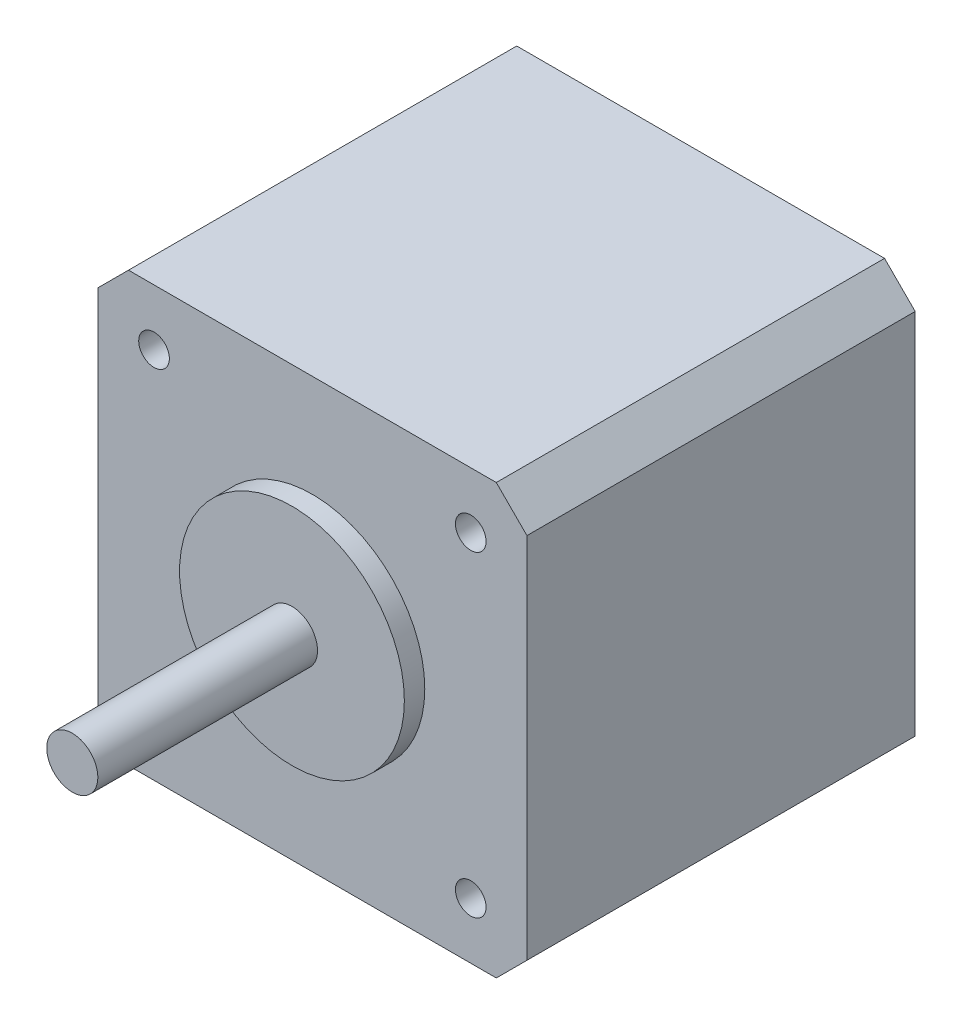
ISO-10303-21;
HEADER;
FILE_DESCRIPTION(('STEP AP214'),'2;1');
FILE_NAME('part.step','',(''),(''),'','','');
FILE_SCHEMA(('AUTOMOTIVE_DESIGN { 1 0 10303 214 1 1 1 1 }'));
ENDSEC;
DATA;
#1=APPLICATION_CONTEXT('core data for automotive mechanical design processes');
#2=APPLICATION_PROTOCOL_DEFINITION('international standard','automotive_design',2000,#1);
#3=PRODUCT_CONTEXT('',#1,'mechanical');
#4=PRODUCT('Part','Part','',(#3));
#5=PRODUCT_RELATED_PRODUCT_CATEGORY('part','',(#4));
#6=PRODUCT_DEFINITION_FORMATION('','',#4);
#7=PRODUCT_DEFINITION_CONTEXT('part definition',#1,'design');
#8=PRODUCT_DEFINITION('design','',#6,#7);
#9=PRODUCT_DEFINITION_SHAPE('','',#8);
#10=(LENGTH_UNIT() NAMED_UNIT(*) SI_UNIT(.MILLI.,.METRE.));
#11=(NAMED_UNIT(*) PLANE_ANGLE_UNIT() SI_UNIT($,.RADIAN.));
#12=(NAMED_UNIT(*) SI_UNIT($,.STERADIAN.) SOLID_ANGLE_UNIT());
#13=UNCERTAINTY_MEASURE_WITH_UNIT(LENGTH_MEASURE(1.E-05),#10,'distance_accuracy_value','');
#14=(GEOMETRIC_REPRESENTATION_CONTEXT(3) GLOBAL_UNCERTAINTY_ASSIGNED_CONTEXT((#13)) GLOBAL_UNIT_ASSIGNED_CONTEXT((#10,
#11,#12)) REPRESENTATION_CONTEXT('',''));
#15=CARTESIAN_POINT('',(0.,0.,0.));
#16=DIRECTION('',(0.,0.,1.));
#17=DIRECTION('',(1.,0.,0.));
#18=AXIS2_PLACEMENT_3D('',#15,#16,#17);
#19=CARTESIAN_POINT('',(21.,21.,38.));
#20=DIRECTION('',(-1.,0.,0.));
#21=DIRECTION('',(0.,0.,1.));
#22=AXIS2_PLACEMENT_3D('',#19,#20,#21);
#23=PLANE('',#22);
#24=DIRECTION('',(0.,1.,0.));
#25=VECTOR('',#24,1.);
#26=CARTESIAN_POINT('',(21.,21.,38.));
#27=LINE('',#26,#25);
#28=CARTESIAN_POINT('',(21.,-18.,38.));
#29=VERTEX_POINT('',#28);
#30=CARTESIAN_POINT('',(21.,18.,38.));
#31=VERTEX_POINT('',#30);
#32=EDGE_CURVE('E132',#29,#31,#27,.T.);
#33=ORIENTED_EDGE('',*,*,#32,.F.);
#34=DIRECTION('',(0.,0.,-1.));
#35=VECTOR('',#34,1.);
#36=CARTESIAN_POINT('',(21.,-18.,38.));
#37=LINE('',#36,#35);
#38=CARTESIAN_POINT('',(21.,-18.,0.));
#39=VERTEX_POINT('',#38);
#40=EDGE_CURVE('E11',#29,#39,#37,.T.);
#41=ORIENTED_EDGE('',*,*,#40,.T.);
#42=DIRECTION('',(0.,1.,0.));
#43=VECTOR('',#42,1.);
#44=CARTESIAN_POINT('',(21.,21.,0.));
#45=LINE('',#44,#43);
#46=CARTESIAN_POINT('',(21.,18.,0.));
#47=VERTEX_POINT('',#46);
#48=EDGE_CURVE('E164',#39,#47,#45,.T.);
#49=ORIENTED_EDGE('',*,*,#48,.T.);
#50=DIRECTION('',(0.,0.,1.));
#51=VECTOR('',#50,1.);
#52=CARTESIAN_POINT('',(21.,18.,38.));
#53=LINE('',#52,#51);
#54=EDGE_CURVE('E46',#47,#31,#53,.T.);
#55=ORIENTED_EDGE('',*,*,#54,.T.);
#56=EDGE_LOOP('',(#33,#41,#49,#55));
#57=FACE_BOUND('',#56,.T.);
#58=ADVANCED_FACE('F38',(#57),#23,.F.);
#59=CARTESIAN_POINT('',(-21.,21.,38.));
#60=DIRECTION('',(0.,-1.,0.));
#61=DIRECTION('',(0.,0.,-1.));
#62=AXIS2_PLACEMENT_3D('',#59,#60,#61);
#63=PLANE('',#62);
#64=DIRECTION('',(-1.,0.,0.));
#65=VECTOR('',#64,1.);
#66=CARTESIAN_POINT('',(-21.,21.,0.));
#67=LINE('',#66,#65);
#68=CARTESIAN_POINT('',(18.,21.,0.));
#69=VERTEX_POINT('',#68);
#70=CARTESIAN_POINT('',(-18.,21.,0.));
#71=VERTEX_POINT('',#70);
#72=EDGE_CURVE('E137',#69,#71,#67,.T.);
#73=ORIENTED_EDGE('',*,*,#72,.T.);
#74=DIRECTION('',(0.,0.,1.));
#75=VECTOR('',#74,1.);
#76=CARTESIAN_POINT('',(-18.,21.,38.));
#77=LINE('',#76,#75);
#78=CARTESIAN_POINT('',(-18.,21.,38.));
#79=VERTEX_POINT('',#78);
#80=EDGE_CURVE('E53',#71,#79,#77,.T.);
#81=ORIENTED_EDGE('',*,*,#80,.T.);
#82=DIRECTION('',(-1.,0.,0.));
#83=VECTOR('',#82,1.);
#84=CARTESIAN_POINT('',(-21.,21.,38.));
#85=LINE('',#84,#83);
#86=CARTESIAN_POINT('',(18.,21.,38.));
#87=VERTEX_POINT('',#86);
#88=EDGE_CURVE('E135',#87,#79,#85,.T.);
#89=ORIENTED_EDGE('',*,*,#88,.F.);
#90=DIRECTION('',(0.,0.,-1.));
#91=VECTOR('',#90,1.);
#92=CARTESIAN_POINT('',(18.,21.,38.));
#93=LINE('',#92,#91);
#94=EDGE_CURVE('E156',#87,#69,#93,.T.);
#95=ORIENTED_EDGE('',*,*,#94,.T.);
#96=EDGE_LOOP('',(#73,#81,#89,#95));
#97=FACE_BOUND('',#96,.T.);
#98=ADVANCED_FACE('F171',(#97),#63,.F.);
#99=CARTESIAN_POINT('',(-21.,21.,38.));
#100=DIRECTION('',(1.,0.,0.));
#101=DIRECTION('',(0.,1.,0.));
#102=AXIS2_PLACEMENT_3D('',#99,#100,#101);
#103=PLANE('',#102);
#104=DIRECTION('',(0.,-1.,0.));
#105=VECTOR('',#104,1.);
#106=CARTESIAN_POINT('',(-21.,21.,0.));
#107=LINE('',#106,#105);
#108=CARTESIAN_POINT('',(-21.,18.,0.));
#109=VERTEX_POINT('',#108);
#110=CARTESIAN_POINT('',(-21.,-18.,0.));
#111=VERTEX_POINT('',#110);
#112=EDGE_CURVE('E133',#109,#111,#107,.T.);
#113=ORIENTED_EDGE('',*,*,#112,.T.);
#114=DIRECTION('',(0.,0.,1.));
#115=VECTOR('',#114,1.);
#116=CARTESIAN_POINT('',(-21.,-18.,38.));
#117=LINE('',#116,#115);
#118=CARTESIAN_POINT('',(-21.,-18.,38.));
#119=VERTEX_POINT('',#118);
#120=EDGE_CURVE('E110',#111,#119,#117,.T.);
#121=ORIENTED_EDGE('',*,*,#120,.T.);
#122=DIRECTION('',(0.,-1.,0.));
#123=VECTOR('',#122,1.);
#124=CARTESIAN_POINT('',(-21.,21.,38.));
#125=LINE('',#124,#123);
#126=CARTESIAN_POINT('',(-21.,18.,38.));
#127=VERTEX_POINT('',#126);
#128=EDGE_CURVE('E177',#127,#119,#125,.T.);
#129=ORIENTED_EDGE('',*,*,#128,.F.);
#130=DIRECTION('',(0.,0.,-1.));
#131=VECTOR('',#130,1.);
#132=CARTESIAN_POINT('',(-21.,18.,38.));
#133=LINE('',#132,#131);
#134=EDGE_CURVE('E115',#127,#109,#133,.T.);
#135=ORIENTED_EDGE('',*,*,#134,.T.);
#136=EDGE_LOOP('',(#113,#121,#129,#135));
#137=FACE_BOUND('',#136,.T.);
#138=ADVANCED_FACE('F250',(#137),#103,.F.);
#139=CARTESIAN_POINT('',(-21.,-21.,38.));
#140=DIRECTION('',(0.,1.,0.));
#141=DIRECTION('',(0.,0.,1.));
#142=AXIS2_PLACEMENT_3D('',#139,#140,#141);
#143=PLANE('',#142);
#144=DIRECTION('',(1.,0.,0.));
#145=VECTOR('',#144,1.);
#146=CARTESIAN_POINT('',(-21.,-21.,38.));
#147=LINE('',#146,#145);
#148=CARTESIAN_POINT('',(-18.,-21.,38.));
#149=VERTEX_POINT('',#148);
#150=CARTESIAN_POINT('',(18.,-21.,38.));
#151=VERTEX_POINT('',#150);
#152=EDGE_CURVE('E125',#149,#151,#147,.T.);
#153=ORIENTED_EDGE('',*,*,#152,.F.);
#154=DIRECTION('',(0.,0.,-1.));
#155=VECTOR('',#154,1.);
#156=CARTESIAN_POINT('',(-18.,-21.,38.));
#157=LINE('',#156,#155);
#158=CARTESIAN_POINT('',(-18.,-21.,0.));
#159=VERTEX_POINT('',#158);
#160=EDGE_CURVE('E109',#149,#159,#157,.T.);
#161=ORIENTED_EDGE('',*,*,#160,.T.);
#162=DIRECTION('',(1.,0.,0.));
#163=VECTOR('',#162,1.);
#164=CARTESIAN_POINT('',(-21.,-21.,0.));
#165=LINE('',#164,#163);
#166=CARTESIAN_POINT('',(18.,-21.,0.));
#167=VERTEX_POINT('',#166);
#168=EDGE_CURVE('E122',#159,#167,#165,.T.);
#169=ORIENTED_EDGE('',*,*,#168,.T.);
#170=DIRECTION('',(0.,0.,1.));
#171=VECTOR('',#170,1.);
#172=CARTESIAN_POINT('',(18.,-21.,38.));
#173=LINE('',#172,#171);
#174=EDGE_CURVE('E127',#167,#151,#173,.T.);
#175=ORIENTED_EDGE('',*,*,#174,.T.);
#176=EDGE_LOOP('',(#153,#161,#169,#175));
#177=FACE_BOUND('',#176,.T.);
#178=ADVANCED_FACE('F121',(#177),#143,.F.);
#179=CARTESIAN_POINT('',(0.,0.,38.));
#180=DIRECTION('',(0.,0.,1.));
#181=DIRECTION('',(1.,0.,0.));
#182=AXIS2_PLACEMENT_3D('',#179,#180,#181);
#183=PLANE('',#182);
#184=CARTESIAN_POINT('',(-15.5,15.5,38.));
#185=DIRECTION('',(0.,0.,1.));
#186=DIRECTION('',(1.,0.,0.));
#187=AXIS2_PLACEMENT_3D('',#184,#185,#186);
#188=CIRCLE('',#187,1.5);
#189=CARTESIAN_POINT('',(-14.,15.5,38.));
#190=VERTEX_POINT('',#189);
#191=EDGE_CURVE('E196',#190,#190,#188,.T.);
#192=ORIENTED_EDGE('',*,*,#191,.F.);
#193=EDGE_LOOP('',(#192));
#194=FACE_BOUND('',#193,.T.);
#195=CARTESIAN_POINT('',(-15.5,-15.5,38.));
#196=DIRECTION('',(0.,0.,1.));
#197=DIRECTION('',(1.,0.,0.));
#198=AXIS2_PLACEMENT_3D('',#195,#196,#197);
#199=CIRCLE('',#198,1.5);
#200=CARTESIAN_POINT('',(-14.,-15.5,38.));
#201=VERTEX_POINT('',#200);
#202=EDGE_CURVE('E202',#201,#201,#199,.T.);
#203=ORIENTED_EDGE('',*,*,#202,.F.);
#204=EDGE_LOOP('',(#203));
#205=FACE_BOUND('',#204,.T.);
#206=CARTESIAN_POINT('',(15.5,-15.5,38.));
#207=DIRECTION('',(0.,0.,1.));
#208=DIRECTION('',(1.,0.,0.));
#209=AXIS2_PLACEMENT_3D('',#206,#207,#208);
#210=CIRCLE('',#209,1.5);
#211=CARTESIAN_POINT('',(17.,-15.5,38.));
#212=VERTEX_POINT('',#211);
#213=EDGE_CURVE('E208',#212,#212,#210,.T.);
#214=ORIENTED_EDGE('',*,*,#213,.F.);
#215=EDGE_LOOP('',(#214));
#216=FACE_BOUND('',#215,.T.);
#217=CARTESIAN_POINT('',(15.5,15.5,38.));
#218=DIRECTION('',(0.,0.,1.));
#219=DIRECTION('',(1.,0.,0.));
#220=AXIS2_PLACEMENT_3D('',#217,#218,#219);
#221=CIRCLE('',#220,1.5);
#222=CARTESIAN_POINT('',(17.,15.5,38.));
#223=VERTEX_POINT('',#222);
#224=EDGE_CURVE('E190',#223,#223,#221,.T.);
#225=ORIENTED_EDGE('',*,*,#224,.F.);
#226=EDGE_LOOP('',(#225));
#227=FACE_BOUND('',#226,.T.);
#228=CARTESIAN_POINT('',(0.,0.,38.));
#229=DIRECTION('',(0.,0.,1.));
#230=DIRECTION('',(1.,0.,0.));
#231=AXIS2_PLACEMENT_3D('',#228,#229,#230);
#232=CIRCLE('',#231,11.);
#233=CARTESIAN_POINT('',(11.,0.,38.));
#234=VERTEX_POINT('',#233);
#235=EDGE_CURVE('E176',#234,#234,#232,.T.);
#236=ORIENTED_EDGE('',*,*,#235,.F.);
#237=EDGE_LOOP('',(#236));
#238=FACE_BOUND('',#237,.T.);
#239=ORIENTED_EDGE('',*,*,#128,.T.);
#240=DIRECTION('',(-0.707106781186546,0.707106781186549,0.));
#241=VECTOR('',#240,1.);
#242=CARTESIAN_POINT('',(-19.5000000000001,-19.5,38.));
#243=LINE('',#242,#241);
#244=EDGE_CURVE('E154',#119,#149,#243,.F.);
#245=ORIENTED_EDGE('',*,*,#244,.T.);
#246=ORIENTED_EDGE('',*,*,#152,.T.);
#247=DIRECTION('',(-0.70710678118655,-0.707106781186545,0.));
#248=VECTOR('',#247,1.);
#249=CARTESIAN_POINT('',(19.4999999999999,-19.5000000000001,38.));
#250=LINE('',#249,#248);
#251=EDGE_CURVE('E150',#151,#29,#250,.F.);
#252=ORIENTED_EDGE('',*,*,#251,.T.);
#253=ORIENTED_EDGE('',*,*,#32,.T.);
#254=DIRECTION('',(0.707106781186546,-0.707106781186549,0.));
#255=VECTOR('',#254,1.);
#256=CARTESIAN_POINT('',(19.5,19.5,38.));
#257=LINE('',#256,#255);
#258=EDGE_CURVE('E60',#31,#87,#257,.F.);
#259=ORIENTED_EDGE('',*,*,#258,.T.);
#260=ORIENTED_EDGE('',*,*,#88,.T.);
#261=DIRECTION('',(0.707106781186548,0.707106781186548,0.));
#262=VECTOR('',#261,1.);
#263=CARTESIAN_POINT('',(-19.5,19.5,38.));
#264=LINE('',#263,#262);
#265=EDGE_CURVE('E152',#79,#127,#264,.F.);
#266=ORIENTED_EDGE('',*,*,#265,.T.);
#267=EDGE_LOOP('',(#239,#245,#246,#252,#253,#259,#260,#266));
#268=FACE_BOUND('',#267,.T.);
#269=ADVANCED_FACE('F167',(#194,#205,#216,#227,#238,#268),#183,.T.);
#270=CARTESIAN_POINT('',(0.,0.,0.));
#271=DIRECTION('',(0.,0.,1.));
#272=DIRECTION('',(1.,0.,0.));
#273=AXIS2_PLACEMENT_3D('',#270,#271,#272);
#274=PLANE('',#273);
#275=ORIENTED_EDGE('',*,*,#168,.F.);
#276=DIRECTION('',(0.707106781186546,-0.707106781186549,0.));
#277=VECTOR('',#276,1.);
#278=CARTESIAN_POINT('',(-18.,-21.,0.));
#279=LINE('',#278,#277);
#280=EDGE_CURVE('E105',#159,#111,#279,.F.);
#281=ORIENTED_EDGE('',*,*,#280,.T.);
#282=ORIENTED_EDGE('',*,*,#112,.F.);
#283=DIRECTION('',(-0.707106781186548,-0.707106781186548,0.));
#284=VECTOR('',#283,1.);
#285=CARTESIAN_POINT('',(-21.,18.,0.));
#286=LINE('',#285,#284);
#287=EDGE_CURVE('E116',#109,#71,#286,.F.);
#288=ORIENTED_EDGE('',*,*,#287,.T.);
#289=ORIENTED_EDGE('',*,*,#72,.F.);
#290=DIRECTION('',(-0.707106781186546,0.707106781186549,0.));
#291=VECTOR('',#290,1.);
#292=CARTESIAN_POINT('',(18.,21.,0.));
#293=LINE('',#292,#291);
#294=EDGE_CURVE('E126',#69,#47,#293,.F.);
#295=ORIENTED_EDGE('',*,*,#294,.T.);
#296=ORIENTED_EDGE('',*,*,#48,.F.);
#297=DIRECTION('',(0.70710678118655,0.707106781186545,0.));
#298=VECTOR('',#297,1.);
#299=CARTESIAN_POINT('',(21.,-18.,0.));
#300=LINE('',#299,#298);
#301=EDGE_CURVE('E131',#39,#167,#300,.F.);
#302=ORIENTED_EDGE('',*,*,#301,.T.);
#303=EDGE_LOOP('',(#275,#281,#282,#288,#289,#295,#296,#302));
#304=FACE_BOUND('',#303,.T.);
#305=ADVANCED_FACE('F129',(#304),#274,.F.);
#306=CARTESIAN_POINT('',(0.,0.,40.));
#307=DIRECTION('',(0.,0.,-1.));
#308=DIRECTION('',(-1.,0.,0.));
#309=AXIS2_PLACEMENT_3D('',#306,#307,#308);
#310=CYLINDRICAL_SURFACE('',#309,11.);
#311=CARTESIAN_POINT('',(0.,0.,40.));
#312=DIRECTION('',(0.,0.,1.));
#313=DIRECTION('',(1.,0.,0.));
#314=AXIS2_PLACEMENT_3D('',#311,#312,#313);
#315=CIRCLE('',#314,11.);
#316=CARTESIAN_POINT('',(11.,0.,40.));
#317=VERTEX_POINT('',#316);
#318=EDGE_CURVE('E172',#317,#317,#315,.T.);
#319=ORIENTED_EDGE('',*,*,#318,.F.);
#320=EDGE_LOOP('',(#319));
#321=FACE_BOUND('',#320,.T.);
#322=ORIENTED_EDGE('',*,*,#235,.T.);
#323=EDGE_LOOP('',(#322));
#324=FACE_BOUND('',#323,.T.);
#325=ADVANCED_FACE('F231',(#321,#324),#310,.T.);
#326=CARTESIAN_POINT('',(0.,0.,40.));
#327=DIRECTION('',(0.,0.,1.));
#328=DIRECTION('',(1.,0.,0.));
#329=AXIS2_PLACEMENT_3D('',#326,#327,#328);
#330=PLANE('',#329);
#331=CARTESIAN_POINT('',(0.,0.,40.));
#332=DIRECTION('',(0.,0.,1.));
#333=DIRECTION('',(1.,0.,0.));
#334=AXIS2_PLACEMENT_3D('',#331,#332,#333);
#335=CIRCLE('',#334,2.5);
#336=CARTESIAN_POINT('',(2.5,0.,40.));
#337=VERTEX_POINT('',#336);
#338=EDGE_CURVE('E141',#337,#337,#335,.T.);
#339=ORIENTED_EDGE('',*,*,#338,.F.);
#340=EDGE_LOOP('',(#339));
#341=FACE_BOUND('',#340,.T.);
#342=ORIENTED_EDGE('',*,*,#318,.T.);
#343=EDGE_LOOP('',(#342));
#344=FACE_BOUND('',#343,.T.);
#345=ADVANCED_FACE('F233',(#341,#344),#330,.T.);
#346=CARTESIAN_POINT('',(0.,0.,61.5));
#347=DIRECTION('',(0.,0.,-1.));
#348=DIRECTION('',(-1.,0.,0.));
#349=AXIS2_PLACEMENT_3D('',#346,#347,#348);
#350=CYLINDRICAL_SURFACE('',#349,2.5);
#351=CARTESIAN_POINT('',(0.,0.,61.5));
#352=DIRECTION('',(0.,0.,1.));
#353=DIRECTION('',(1.,0.,0.));
#354=AXIS2_PLACEMENT_3D('',#351,#352,#353);
#355=CIRCLE('',#354,2.5);
#356=CARTESIAN_POINT('',(2.5,0.,61.5));
#357=VERTEX_POINT('',#356);
#358=EDGE_CURVE('E184',#357,#357,#355,.T.);
#359=ORIENTED_EDGE('',*,*,#358,.F.);
#360=EDGE_LOOP('',(#359));
#361=FACE_BOUND('',#360,.T.);
#362=ORIENTED_EDGE('',*,*,#338,.T.);
#363=EDGE_LOOP('',(#362));
#364=FACE_BOUND('',#363,.T.);
#365=ADVANCED_FACE('F240',(#361,#364),#350,.T.);
#366=CARTESIAN_POINT('',(0.,0.,61.5));
#367=DIRECTION('',(0.,0.,1.));
#368=DIRECTION('',(1.,0.,0.));
#369=AXIS2_PLACEMENT_3D('',#366,#367,#368);
#370=PLANE('',#369);
#371=ORIENTED_EDGE('',*,*,#358,.T.);
#372=EDGE_LOOP('',(#371));
#373=FACE_BOUND('',#372,.T.);
#374=ADVANCED_FACE('F365',(#373),#370,.T.);
#375=CARTESIAN_POINT('',(15.5,15.5,33.5));
#376=DIRECTION('',(0.,0.,1.));
#377=DIRECTION('',(1.,0.,0.));
#378=AXIS2_PLACEMENT_3D('',#375,#376,#377);
#379=CYLINDRICAL_SURFACE('',#378,1.5);
#380=CARTESIAN_POINT('',(15.5,15.5,33.5));
#381=DIRECTION('',(0.,0.,1.));
#382=DIRECTION('',(1.,0.,0.));
#383=AXIS2_PLACEMENT_3D('',#380,#381,#382);
#384=CIRCLE('',#383,1.5);
#385=CARTESIAN_POINT('',(17.,15.5,33.5));
#386=VERTEX_POINT('',#385);
#387=EDGE_CURVE('E189',#386,#386,#384,.T.);
#388=ORIENTED_EDGE('',*,*,#387,.F.);
#389=EDGE_LOOP('',(#388));
#390=FACE_BOUND('',#389,.T.);
#391=ORIENTED_EDGE('',*,*,#224,.T.);
#392=EDGE_LOOP('',(#391));
#393=FACE_BOUND('',#392,.T.);
#394=ADVANCED_FACE('F357',(#390,#393),#379,.F.);
#395=CARTESIAN_POINT('',(15.5,15.5,33.5));
#396=DIRECTION('',(0.,0.,1.));
#397=DIRECTION('',(1.,0.,0.));
#398=AXIS2_PLACEMENT_3D('',#395,#396,#397);
#399=PLANE('',#398);
#400=ORIENTED_EDGE('',*,*,#387,.T.);
#401=EDGE_LOOP('',(#400));
#402=FACE_BOUND('',#401,.T.);
#403=ADVANCED_FACE('F219',(#402),#399,.T.);
#404=CARTESIAN_POINT('',(15.5,-15.5,33.5));
#405=DIRECTION('',(0.,0.,1.));
#406=DIRECTION('',(1.,0.,0.));
#407=AXIS2_PLACEMENT_3D('',#404,#405,#406);
#408=CYLINDRICAL_SURFACE('',#407,1.5);
#409=CARTESIAN_POINT('',(15.5,-15.5,33.5));
#410=DIRECTION('',(0.,0.,1.));
#411=DIRECTION('',(1.,0.,0.));
#412=AXIS2_PLACEMENT_3D('',#409,#410,#411);
#413=CIRCLE('',#412,1.5);
#414=CARTESIAN_POINT('',(17.,-15.5,33.5));
#415=VERTEX_POINT('',#414);
#416=EDGE_CURVE('E193',#415,#415,#413,.T.);
#417=ORIENTED_EDGE('',*,*,#416,.F.);
#418=EDGE_LOOP('',(#417));
#419=FACE_BOUND('',#418,.T.);
#420=ORIENTED_EDGE('',*,*,#213,.T.);
#421=EDGE_LOOP('',(#420));
#422=FACE_BOUND('',#421,.T.);
#423=ADVANCED_FACE('F216',(#419,#422),#408,.F.);
#424=CARTESIAN_POINT('',(15.5,-15.5,33.5));
#425=DIRECTION('',(0.,0.,1.));
#426=DIRECTION('',(1.,0.,0.));
#427=AXIS2_PLACEMENT_3D('',#424,#425,#426);
#428=PLANE('',#427);
#429=ORIENTED_EDGE('',*,*,#416,.T.);
#430=EDGE_LOOP('',(#429));
#431=FACE_BOUND('',#430,.T.);
#432=ADVANCED_FACE('F214',(#431),#428,.T.);
#433=CARTESIAN_POINT('',(-15.5,-15.5,33.5));
#434=DIRECTION('',(0.,0.,1.));
#435=DIRECTION('',(1.,0.,0.));
#436=AXIS2_PLACEMENT_3D('',#433,#434,#435);
#437=CYLINDRICAL_SURFACE('',#436,1.5);
#438=CARTESIAN_POINT('',(-15.5,-15.5,33.5));
#439=DIRECTION('',(0.,0.,1.));
#440=DIRECTION('',(1.,0.,0.));
#441=AXIS2_PLACEMENT_3D('',#438,#439,#440);
#442=CIRCLE('',#441,1.5);
#443=CARTESIAN_POINT('',(-14.,-15.5,33.5));
#444=VERTEX_POINT('',#443);
#445=EDGE_CURVE('E205',#444,#444,#442,.T.);
#446=ORIENTED_EDGE('',*,*,#445,.F.);
#447=EDGE_LOOP('',(#446));
#448=FACE_BOUND('',#447,.T.);
#449=ORIENTED_EDGE('',*,*,#202,.T.);
#450=EDGE_LOOP('',(#449));
#451=FACE_BOUND('',#450,.T.);
#452=ADVANCED_FACE('F332',(#448,#451),#437,.F.);
#453=CARTESIAN_POINT('',(-15.5,-15.5,33.5));
#454=DIRECTION('',(0.,0.,1.));
#455=DIRECTION('',(1.,0.,0.));
#456=AXIS2_PLACEMENT_3D('',#453,#454,#455);
#457=PLANE('',#456);
#458=ORIENTED_EDGE('',*,*,#445,.T.);
#459=EDGE_LOOP('',(#458));
#460=FACE_BOUND('',#459,.T.);
#461=ADVANCED_FACE('F324',(#460),#457,.T.);
#462=CARTESIAN_POINT('',(-15.5,15.5,33.5));
#463=DIRECTION('',(0.,0.,1.));
#464=DIRECTION('',(1.,0.,0.));
#465=AXIS2_PLACEMENT_3D('',#462,#463,#464);
#466=CYLINDRICAL_SURFACE('',#465,1.5);
#467=CARTESIAN_POINT('',(-15.5,15.5,33.5));
#468=DIRECTION('',(0.,0.,1.));
#469=DIRECTION('',(1.,0.,0.));
#470=AXIS2_PLACEMENT_3D('',#467,#468,#469);
#471=CIRCLE('',#470,1.5);
#472=CARTESIAN_POINT('',(-14.,15.5,33.5));
#473=VERTEX_POINT('',#472);
#474=EDGE_CURVE('E199',#473,#473,#471,.T.);
#475=ORIENTED_EDGE('',*,*,#474,.F.);
#476=EDGE_LOOP('',(#475));
#477=FACE_BOUND('',#476,.T.);
#478=ORIENTED_EDGE('',*,*,#191,.T.);
#479=EDGE_LOOP('',(#478));
#480=FACE_BOUND('',#479,.T.);
#481=ADVANCED_FACE('F317',(#477,#480),#466,.F.);
#482=CARTESIAN_POINT('',(-15.5,15.5,33.5));
#483=DIRECTION('',(0.,0.,1.));
#484=DIRECTION('',(1.,0.,0.));
#485=AXIS2_PLACEMENT_3D('',#482,#483,#484);
#486=PLANE('',#485);
#487=ORIENTED_EDGE('',*,*,#474,.T.);
#488=EDGE_LOOP('',(#487));
#489=FACE_BOUND('',#488,.T.);
#490=ADVANCED_FACE('F257',(#489),#486,.T.);
#491=CARTESIAN_POINT('',(-18.,-21.,38.));
#492=DIRECTION('',(0.707106781186549,0.707106781186546,0.));
#493=DIRECTION('',(0.,0.,-1.));
#494=AXIS2_PLACEMENT_3D('',#491,#492,#493);
#495=PLANE('',#494);
#496=ORIENTED_EDGE('',*,*,#244,.F.);
#497=ORIENTED_EDGE('',*,*,#120,.F.);
#498=ORIENTED_EDGE('',*,*,#280,.F.);
#499=ORIENTED_EDGE('',*,*,#160,.F.);
#500=EDGE_LOOP('',(#496,#497,#498,#499));
#501=FACE_BOUND('',#500,.T.);
#502=ADVANCED_FACE('F108',(#501),#495,.F.);
#503=CARTESIAN_POINT('',(-21.,18.,38.));
#504=DIRECTION('',(0.707106781186548,-0.707106781186548,0.));
#505=DIRECTION('',(0.,0.,-1.));
#506=AXIS2_PLACEMENT_3D('',#503,#504,#505);
#507=PLANE('',#506);
#508=ORIENTED_EDGE('',*,*,#265,.F.);
#509=ORIENTED_EDGE('',*,*,#80,.F.);
#510=ORIENTED_EDGE('',*,*,#287,.F.);
#511=ORIENTED_EDGE('',*,*,#134,.F.);
#512=EDGE_LOOP('',(#508,#509,#510,#511));
#513=FACE_BOUND('',#512,.T.);
#514=ADVANCED_FACE('F256',(#513),#507,.F.);
#515=CARTESIAN_POINT('',(21.,-18.,38.));
#516=DIRECTION('',(-0.707106781186545,0.70710678118655,0.));
#517=DIRECTION('',(0.,0.,-1.));
#518=AXIS2_PLACEMENT_3D('',#515,#516,#517);
#519=PLANE('',#518);
#520=ORIENTED_EDGE('',*,*,#251,.F.);
#521=ORIENTED_EDGE('',*,*,#174,.F.);
#522=ORIENTED_EDGE('',*,*,#301,.F.);
#523=ORIENTED_EDGE('',*,*,#40,.F.);
#524=EDGE_LOOP('',(#520,#521,#522,#523));
#525=FACE_BOUND('',#524,.T.);
#526=ADVANCED_FACE('F259',(#525),#519,.F.);
#527=CARTESIAN_POINT('',(18.,21.,38.));
#528=DIRECTION('',(-0.707106781186549,-0.707106781186546,0.));
#529=DIRECTION('',(0.,0.,-1.));
#530=AXIS2_PLACEMENT_3D('',#527,#528,#529);
#531=PLANE('',#530);
#532=ORIENTED_EDGE('',*,*,#258,.F.);
#533=ORIENTED_EDGE('',*,*,#54,.F.);
#534=ORIENTED_EDGE('',*,*,#294,.F.);
#535=ORIENTED_EDGE('',*,*,#94,.F.);
#536=EDGE_LOOP('',(#532,#533,#534,#535));
#537=FACE_BOUND('',#536,.T.);
#538=ADVANCED_FACE('F40',(#537),#531,.F.);
#539=CLOSED_SHELL('',(#58,#98,#138,#178,#269,#305,#325,#345,#365,#374,#394,#403,#423,#432,#452,
#461,#481,#490,#502,#514,#526,#538));
#540=MANIFOLD_SOLID_BREP('B2',#539);
#541=ADVANCED_BREP_SHAPE_REPRESENTATION('',(#18,#540),#14);
#542=SHAPE_DEFINITION_REPRESENTATION(#9,#541);
ENDSEC;
END-ISO-10303-21;
